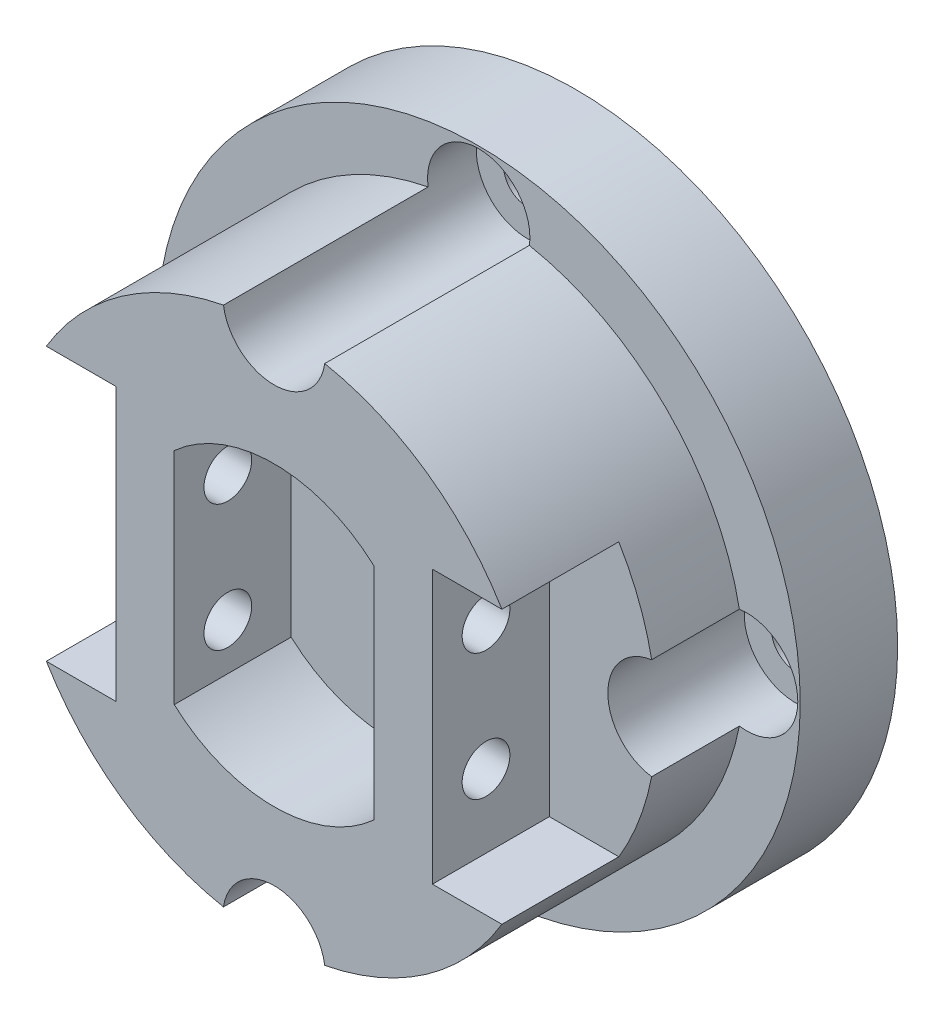
ISO-10303-21;
HEADER;
FILE_DESCRIPTION(('STEP AP214'),'2;1');
FILE_NAME('part.step','',(''),(''),'','','');
FILE_SCHEMA(('AUTOMOTIVE_DESIGN { 1 0 10303 214 1 1 1 1 }'));
ENDSEC;
DATA;
#1=APPLICATION_CONTEXT('core data for automotive mechanical design processes');
#2=APPLICATION_PROTOCOL_DEFINITION('international standard','automotive_design',2000,#1);
#3=PRODUCT_CONTEXT('',#1,'mechanical');
#4=PRODUCT('Part','Part','',(#3));
#5=PRODUCT_RELATED_PRODUCT_CATEGORY('part','',(#4));
#6=PRODUCT_DEFINITION_FORMATION('','',#4);
#7=PRODUCT_DEFINITION_CONTEXT('part definition',#1,'design');
#8=PRODUCT_DEFINITION('design','',#6,#7);
#9=PRODUCT_DEFINITION_SHAPE('','',#8);
#10=(LENGTH_UNIT() NAMED_UNIT(*) SI_UNIT(.MILLI.,.METRE.));
#11=(NAMED_UNIT(*) PLANE_ANGLE_UNIT() SI_UNIT($,.RADIAN.));
#12=(NAMED_UNIT(*) SI_UNIT($,.STERADIAN.) SOLID_ANGLE_UNIT());
#13=UNCERTAINTY_MEASURE_WITH_UNIT(LENGTH_MEASURE(1.E-05),#10,'distance_accuracy_value','');
#14=(GEOMETRIC_REPRESENTATION_CONTEXT(3) GLOBAL_UNCERTAINTY_ASSIGNED_CONTEXT((#13)) GLOBAL_UNIT_ASSIGNED_CONTEXT((#10,
#11,#12)) REPRESENTATION_CONTEXT('',''));
#15=CARTESIAN_POINT('',(0.,0.,0.));
#16=DIRECTION('',(0.,0.,1.));
#17=DIRECTION('',(1.,0.,0.));
#18=AXIS2_PLACEMENT_3D('',#15,#16,#17);
#19=CARTESIAN_POINT('',(0.,-27.5,36.));
#20=DIRECTION('',(0.,0.,-1.));
#21=DIRECTION('',(-1.,0.,0.));
#22=AXIS2_PLACEMENT_3D('',#19,#20,#21);
#23=CYLINDRICAL_SURFACE('',#22,2.45);
#24=CARTESIAN_POINT('',(0.,-27.5,0.));
#25=DIRECTION('',(0.,0.,-1.));
#26=DIRECTION('',(-1.,0.,0.));
#27=AXIS2_PLACEMENT_3D('',#24,#25,#26);
#28=CIRCLE('',#27,2.45);
#29=CARTESIAN_POINT('',(-2.45000000000001,-27.5,0.));
#30=VERTEX_POINT('',#29);
#31=EDGE_CURVE('E353',#30,#30,#28,.T.);
#32=ORIENTED_EDGE('',*,*,#31,.T.);
#33=EDGE_LOOP('',(#32));
#34=FACE_BOUND('',#33,.T.);
#35=CARTESIAN_POINT('',(0.,-27.5,5.));
#36=DIRECTION('',(0.,0.,1.));
#37=DIRECTION('',(1.,0.,0.));
#38=AXIS2_PLACEMENT_3D('',#35,#36,#37);
#39=CIRCLE('',#38,2.45);
#40=CARTESIAN_POINT('',(2.45,-27.5,5.));
#41=VERTEX_POINT('',#40);
#42=EDGE_CURVE('E247',#41,#41,#39,.F.);
#43=ORIENTED_EDGE('',*,*,#42,.F.);
#44=EDGE_LOOP('',(#43));
#45=FACE_BOUND('',#44,.T.);
#46=ADVANCED_FACE('F33',(#34,#45),#23,.F.);
#47=CARTESIAN_POINT('',(-27.5,0.,36.));
#48=DIRECTION('',(0.,0.,-1.));
#49=DIRECTION('',(-1.,0.,0.));
#50=AXIS2_PLACEMENT_3D('',#47,#48,#49);
#51=CYLINDRICAL_SURFACE('',#50,2.45);
#52=CARTESIAN_POINT('',(-27.5,0.,0.));
#53=DIRECTION('',(0.,0.,-1.));
#54=DIRECTION('',(-1.,0.,0.));
#55=AXIS2_PLACEMENT_3D('',#52,#53,#54);
#56=CIRCLE('',#55,2.45);
#57=CARTESIAN_POINT('',(-29.95,0.,0.));
#58=VERTEX_POINT('',#57);
#59=EDGE_CURVE('E350',#58,#58,#56,.T.);
#60=ORIENTED_EDGE('',*,*,#59,.T.);
#61=EDGE_LOOP('',(#60));
#62=FACE_BOUND('',#61,.T.);
#63=CARTESIAN_POINT('',(-27.5,0.,5.));
#64=DIRECTION('',(0.,0.,1.));
#65=DIRECTION('',(1.,0.,0.));
#66=AXIS2_PLACEMENT_3D('',#63,#64,#65);
#67=CIRCLE('',#66,2.45);
#68=CARTESIAN_POINT('',(-25.05,0.,5.));
#69=VERTEX_POINT('',#68);
#70=EDGE_CURVE('E243',#69,#69,#67,.F.);
#71=ORIENTED_EDGE('',*,*,#70,.F.);
#72=EDGE_LOOP('',(#71));
#73=FACE_BOUND('',#72,.T.);
#74=ADVANCED_FACE('F483',(#62,#73),#51,.F.);
#75=CARTESIAN_POINT('',(27.5,0.,36.));
#76=DIRECTION('',(0.,0.,-1.));
#77=DIRECTION('',(-1.,0.,0.));
#78=AXIS2_PLACEMENT_3D('',#75,#76,#77);
#79=CYLINDRICAL_SURFACE('',#78,2.45);
#80=CARTESIAN_POINT('',(27.5,0.,0.));
#81=DIRECTION('',(0.,0.,-1.));
#82=DIRECTION('',(-1.,0.,0.));
#83=AXIS2_PLACEMENT_3D('',#80,#81,#82);
#84=CIRCLE('',#83,2.45);
#85=CARTESIAN_POINT('',(25.05,0.,0.));
#86=VERTEX_POINT('',#85);
#87=EDGE_CURVE('E356',#86,#86,#84,.T.);
#88=ORIENTED_EDGE('',*,*,#87,.T.);
#89=EDGE_LOOP('',(#88));
#90=FACE_BOUND('',#89,.T.);
#91=CARTESIAN_POINT('',(27.5,0.,5.));
#92=DIRECTION('',(0.,0.,1.));
#93=DIRECTION('',(1.,0.,0.));
#94=AXIS2_PLACEMENT_3D('',#91,#92,#93);
#95=CIRCLE('',#94,2.45);
#96=CARTESIAN_POINT('',(29.95,0.,5.));
#97=VERTEX_POINT('',#96);
#98=EDGE_CURVE('E237',#97,#97,#95,.F.);
#99=ORIENTED_EDGE('',*,*,#98,.F.);
#100=EDGE_LOOP('',(#99));
#101=FACE_BOUND('',#100,.T.);
#102=ADVANCED_FACE('F480',(#90,#101),#79,.F.);
#103=CARTESIAN_POINT('',(0.,27.5,36.));
#104=DIRECTION('',(0.,0.,-1.));
#105=DIRECTION('',(-1.,0.,0.));
#106=AXIS2_PLACEMENT_3D('',#103,#104,#105);
#107=CYLINDRICAL_SURFACE('',#106,2.45);
#108=CARTESIAN_POINT('',(0.,27.5,0.));
#109=DIRECTION('',(0.,0.,-1.));
#110=DIRECTION('',(-1.,0.,0.));
#111=AXIS2_PLACEMENT_3D('',#108,#109,#110);
#112=CIRCLE('',#111,2.45);
#113=CARTESIAN_POINT('',(-2.44999999999999,27.5,0.));
#114=VERTEX_POINT('',#113);
#115=EDGE_CURVE('E359',#114,#114,#112,.T.);
#116=ORIENTED_EDGE('',*,*,#115,.T.);
#117=EDGE_LOOP('',(#116));
#118=FACE_BOUND('',#117,.T.);
#119=CARTESIAN_POINT('',(0.,27.5,5.));
#120=DIRECTION('',(0.,0.,1.));
#121=DIRECTION('',(1.,0.,0.));
#122=AXIS2_PLACEMENT_3D('',#119,#120,#121);
#123=CIRCLE('',#122,2.45);
#124=CARTESIAN_POINT('',(2.45000000000001,27.5,5.));
#125=VERTEX_POINT('',#124);
#126=EDGE_CURVE('E228',#125,#125,#123,.F.);
#127=ORIENTED_EDGE('',*,*,#126,.F.);
#128=EDGE_LOOP('',(#127));
#129=FACE_BOUND('',#128,.T.);
#130=ADVANCED_FACE('F482',(#118,#129),#107,.F.);
#131=CARTESIAN_POINT('',(0.,0.,31.));
#132=DIRECTION('',(0.,0.,-1.));
#133=DIRECTION('',(-1.,0.,0.));
#134=AXIS2_PLACEMENT_3D('',#131,#132,#133);
#135=CYLINDRICAL_SURFACE('',#134,27.25);
#136=CARTESIAN_POINT('',(0.,0.,31.));
#137=DIRECTION('',(0.,0.,1.));
#138=DIRECTION('',(1.,0.,0.));
#139=AXIS2_PLACEMENT_3D('',#136,#137,#138);
#140=CIRCLE('',#139,27.25);
#141=CARTESIAN_POINT('',(5.19615242270663,-26.75,31.));
#142=VERTEX_POINT('',#141);
#143=CARTESIAN_POINT('',(23.3786761815121,-14.,31.));
#144=VERTEX_POINT('',#143);
#145=EDGE_CURVE('E181',#142,#144,#140,.T.);
#146=ORIENTED_EDGE('',*,*,#145,.F.);
#147=DIRECTION('',(0.,0.,1.));
#148=VECTOR('',#147,1.);
#149=CARTESIAN_POINT('',(5.19615242270663,-26.75,18.));
#150=LINE('',#149,#148);
#151=CARTESIAN_POINT('',(5.19615242270661,-26.75,10.));
#152=VERTEX_POINT('',#151);
#153=EDGE_CURVE('E167',#142,#152,#150,.F.);
#154=ORIENTED_EDGE('',*,*,#153,.T.);
#155=CARTESIAN_POINT('',(0.,0.,10.));
#156=DIRECTION('',(0.,0.,1.));
#157=DIRECTION('',(1.,0.,0.));
#158=AXIS2_PLACEMENT_3D('',#155,#156,#157);
#159=CIRCLE('',#158,27.25);
#160=CARTESIAN_POINT('',(26.75,-5.19615242270663,10.));
#161=VERTEX_POINT('',#160);
#162=EDGE_CURVE('E462',#152,#161,#159,.T.);
#163=ORIENTED_EDGE('',*,*,#162,.T.);
#164=DIRECTION('',(0.,0.,1.));
#165=VECTOR('',#164,1.);
#166=CARTESIAN_POINT('',(26.75,-5.19615242270664,18.));
#167=LINE('',#166,#165);
#168=CARTESIAN_POINT('',(26.75,-5.19615242270662,19.));
#169=VERTEX_POINT('',#168);
#170=EDGE_CURVE('E269',#161,#169,#167,.T.);
#171=ORIENTED_EDGE('',*,*,#170,.T.);
#172=CARTESIAN_POINT('',(0.,0.,19.));
#173=DIRECTION('',(0.,0.,-1.));
#174=DIRECTION('',(-1.,0.,0.));
#175=AXIS2_PLACEMENT_3D('',#172,#173,#174);
#176=CIRCLE('',#175,27.25);
#177=CARTESIAN_POINT('',(23.3786761815121,-14.,19.));
#178=VERTEX_POINT('',#177);
#179=EDGE_CURVE('E306',#169,#178,#176,.T.);
#180=ORIENTED_EDGE('',*,*,#179,.T.);
#181=DIRECTION('',(0.,0.,-1.));
#182=VECTOR('',#181,1.);
#183=CARTESIAN_POINT('',(23.3786761815121,-14.,31.));
#184=LINE('',#183,#182);
#185=EDGE_CURVE('E191',#144,#178,#184,.T.);
#186=ORIENTED_EDGE('',*,*,#185,.F.);
#187=EDGE_LOOP('',(#146,#154,#163,#171,#180,#186));
#188=FACE_BOUND('',#187,.T.);
#189=ADVANCED_FACE('F189',(#188),#135,.T.);
#190=CARTESIAN_POINT('',(0.,0.,19.));
#191=DIRECTION('',(0.,0.,-1.));
#192=DIRECTION('',(-1.,0.,0.));
#193=AXIS2_PLACEMENT_3D('',#190,#191,#192);
#194=CIRCLE('',#193,27.25);
#195=CARTESIAN_POINT('',(23.3786761815121,14.,19.));
#196=VERTEX_POINT('',#195);
#197=CARTESIAN_POINT('',(26.75,5.19615242270661,19.));
#198=VERTEX_POINT('',#197);
#199=EDGE_CURVE('E303',#196,#198,#194,.T.);
#200=ORIENTED_EDGE('',*,*,#199,.T.);
#201=DIRECTION('',(0.,0.,1.));
#202=VECTOR('',#201,1.);
#203=CARTESIAN_POINT('',(26.75,5.19615242270663,18.));
#204=LINE('',#203,#202);
#205=CARTESIAN_POINT('',(26.75,5.19615242270662,10.));
#206=VERTEX_POINT('',#205);
#207=EDGE_CURVE('E266',#198,#206,#204,.F.);
#208=ORIENTED_EDGE('',*,*,#207,.T.);
#209=CARTESIAN_POINT('',(5.19615242270662,26.75,10.));
#210=VERTEX_POINT('',#209);
#211=EDGE_CURVE('E388',#206,#210,#159,.T.);
#212=ORIENTED_EDGE('',*,*,#211,.T.);
#213=DIRECTION('',(0.,0.,1.));
#214=VECTOR('',#213,1.);
#215=CARTESIAN_POINT('',(5.19615242270664,26.75,18.));
#216=LINE('',#215,#214);
#217=CARTESIAN_POINT('',(5.19615242270664,26.75,31.));
#218=VERTEX_POINT('',#217);
#219=EDGE_CURVE('E278',#210,#218,#216,.T.);
#220=ORIENTED_EDGE('',*,*,#219,.T.);
#221=CARTESIAN_POINT('',(23.3786761815121,14.,31.));
#222=VERTEX_POINT('',#221);
#223=EDGE_CURVE('E192',#222,#218,#140,.T.);
#224=ORIENTED_EDGE('',*,*,#223,.F.);
#225=DIRECTION('',(0.,0.,-1.));
#226=VECTOR('',#225,1.);
#227=CARTESIAN_POINT('',(23.3786761815121,14.,31.));
#228=LINE('',#227,#226);
#229=EDGE_CURVE('E309',#196,#222,#228,.F.);
#230=ORIENTED_EDGE('',*,*,#229,.F.);
#231=EDGE_LOOP('',(#200,#208,#212,#220,#224,#230));
#232=FACE_BOUND('',#231,.T.);
#233=ADVANCED_FACE('F447',(#232),#135,.T.);
#234=CARTESIAN_POINT('',(0.,0.,31.));
#235=DIRECTION('',(0.,0.,1.));
#236=DIRECTION('',(1.,0.,0.));
#237=AXIS2_PLACEMENT_3D('',#234,#235,#236);
#238=PLANE('',#237);
#239=CARTESIAN_POINT('',(0.,-27.5,31.));
#240=DIRECTION('',(0.,0.,1.));
#241=DIRECTION('',(1.,0.,0.));
#242=AXIS2_PLACEMENT_3D('',#239,#240,#241);
#243=CIRCLE('',#242,5.25);
#244=CARTESIAN_POINT('',(-5.19615242270664,-26.75,31.));
#245=VERTEX_POINT('',#244);
#246=EDGE_CURVE('E170',#142,#245,#243,.T.);
#247=ORIENTED_EDGE('',*,*,#246,.F.);
#248=ORIENTED_EDGE('',*,*,#145,.T.);
#249=DIRECTION('',(-1.,0.,0.));
#250=VECTOR('',#249,1.);
#251=CARTESIAN_POINT('',(16.25,-14.,31.));
#252=LINE('',#251,#250);
#253=CARTESIAN_POINT('',(16.25,-14.,31.));
#254=VERTEX_POINT('',#253);
#255=EDGE_CURVE('E294',#144,#254,#252,.T.);
#256=ORIENTED_EDGE('',*,*,#255,.T.);
#257=DIRECTION('',(0.,1.,0.));
#258=VECTOR('',#257,1.);
#259=CARTESIAN_POINT('',(16.25,14.,31.));
#260=LINE('',#259,#258);
#261=CARTESIAN_POINT('',(16.25,14.,31.));
#262=VERTEX_POINT('',#261);
#263=EDGE_CURVE('E281',#254,#262,#260,.T.);
#264=ORIENTED_EDGE('',*,*,#263,.T.);
#265=DIRECTION('',(1.,0.,0.));
#266=VECTOR('',#265,1.);
#267=CARTESIAN_POINT('',(16.25,14.,31.));
#268=LINE('',#267,#266);
#269=EDGE_CURVE('E286',#262,#222,#268,.T.);
#270=ORIENTED_EDGE('',*,*,#269,.T.);
#271=ORIENTED_EDGE('',*,*,#223,.T.);
#272=CARTESIAN_POINT('',(0.,27.5,31.));
#273=DIRECTION('',(0.,0.,1.));
#274=DIRECTION('',(1.,0.,0.));
#275=AXIS2_PLACEMENT_3D('',#272,#273,#274);
#276=CIRCLE('',#275,5.25);
#277=CARTESIAN_POINT('',(-5.19615242270662,26.75,31.));
#278=VERTEX_POINT('',#277);
#279=EDGE_CURVE('E240',#278,#218,#276,.T.);
#280=ORIENTED_EDGE('',*,*,#279,.F.);
#281=CARTESIAN_POINT('',(-23.3786761815121,14.,31.));
#282=VERTEX_POINT('',#281);
#283=EDGE_CURVE('E194',#278,#282,#140,.T.);
#284=ORIENTED_EDGE('',*,*,#283,.T.);
#285=DIRECTION('',(-1.,0.,0.));
#286=VECTOR('',#285,1.);
#287=CARTESIAN_POINT('',(-16.25,14.,31.));
#288=LINE('',#287,#286);
#289=CARTESIAN_POINT('',(-16.25,14.,31.));
#290=VERTEX_POINT('',#289);
#291=EDGE_CURVE('E324',#290,#282,#288,.T.);
#292=ORIENTED_EDGE('',*,*,#291,.F.);
#293=DIRECTION('',(0.,1.,0.));
#294=VECTOR('',#293,1.);
#295=CARTESIAN_POINT('',(-16.25,14.,31.));
#296=LINE('',#295,#294);
#297=CARTESIAN_POINT('',(-16.25,-14.,31.));
#298=VERTEX_POINT('',#297);
#299=EDGE_CURVE('E311',#298,#290,#296,.T.);
#300=ORIENTED_EDGE('',*,*,#299,.F.);
#301=DIRECTION('',(1.,0.,0.));
#302=VECTOR('',#301,1.);
#303=CARTESIAN_POINT('',(-16.25,-14.,31.));
#304=LINE('',#303,#302);
#305=CARTESIAN_POINT('',(-23.3786761815121,-14.,31.));
#306=VERTEX_POINT('',#305);
#307=EDGE_CURVE('E316',#306,#298,#304,.T.);
#308=ORIENTED_EDGE('',*,*,#307,.F.);
#309=EDGE_CURVE('E185',#306,#245,#140,.T.);
#310=ORIENTED_EDGE('',*,*,#309,.T.);
#311=EDGE_LOOP('',(#247,#248,#256,#264,#270,#271,#280,#284,#292,#300,#308,#310));
#312=FACE_BOUND('',#311,.T.);
#313=CARTESIAN_POINT('',(0.,0.,31.));
#314=DIRECTION('',(0.,0.,1.));
#315=DIRECTION('',(1.,0.,0.));
#316=AXIS2_PLACEMENT_3D('',#313,#314,#315);
#317=CIRCLE('',#316,15.25);
#318=CARTESIAN_POINT('',(10.25,11.2915897906362,31.));
#319=VERTEX_POINT('',#318);
#320=CARTESIAN_POINT('',(-10.25,11.2915897906362,31.));
#321=VERTEX_POINT('',#320);
#322=EDGE_CURVE('E362',#319,#321,#317,.T.);
#323=ORIENTED_EDGE('',*,*,#322,.F.);
#324=DIRECTION('',(0.,1.,0.));
#325=VECTOR('',#324,1.);
#326=CARTESIAN_POINT('',(10.25,11.2915897906362,31.));
#327=LINE('',#326,#325);
#328=CARTESIAN_POINT('',(10.25,-11.2915897906362,31.));
#329=VERTEX_POINT('',#328);
#330=EDGE_CURVE('E367',#329,#319,#327,.T.);
#331=ORIENTED_EDGE('',*,*,#330,.F.);
#332=CARTESIAN_POINT('',(0.,0.,31.));
#333=DIRECTION('',(0.,0.,1.));
#334=DIRECTION('',(1.,0.,0.));
#335=AXIS2_PLACEMENT_3D('',#332,#333,#334);
#336=CIRCLE('',#335,15.25);
#337=CARTESIAN_POINT('',(-10.25,-11.2915897906362,31.));
#338=VERTEX_POINT('',#337);
#339=EDGE_CURVE('E381',#338,#329,#336,.T.);
#340=ORIENTED_EDGE('',*,*,#339,.F.);
#341=DIRECTION('',(0.,-1.,0.));
#342=VECTOR('',#341,1.);
#343=CARTESIAN_POINT('',(-10.25,11.2915897906362,31.));
#344=LINE('',#343,#342);
#345=EDGE_CURVE('E378',#321,#338,#344,.T.);
#346=ORIENTED_EDGE('',*,*,#345,.F.);
#347=EDGE_LOOP('',(#323,#331,#340,#346));
#348=FACE_BOUND('',#347,.T.);
#349=ADVANCED_FACE('F178',(#312,#348),#238,.T.);
#350=CARTESIAN_POINT('',(-27.75,6.49999999999999,25.5));
#351=DIRECTION('',(1.,0.,0.));
#352=DIRECTION('',(0.,1.,0.));
#353=AXIS2_PLACEMENT_3D('',#350,#351,#352);
#354=CYLINDRICAL_SURFACE('',#353,2.45);
#355=CARTESIAN_POINT('',(10.25,6.5,25.5));
#356=DIRECTION('',(1.,0.,0.));
#357=DIRECTION('',(0.,1.,0.));
#358=AXIS2_PLACEMENT_3D('',#355,#356,#357);
#359=CIRCLE('',#358,2.45);
#360=CARTESIAN_POINT('',(10.25,8.95,25.5));
#361=VERTEX_POINT('',#360);
#362=EDGE_CURVE('E216',#361,#361,#359,.F.);
#363=ORIENTED_EDGE('',*,*,#362,.T.);
#364=EDGE_LOOP('',(#363));
#365=FACE_BOUND('',#364,.T.);
#366=CARTESIAN_POINT('',(16.25,6.50000000000001,25.5));
#367=DIRECTION('',(1.,0.,0.));
#368=DIRECTION('',(0.,1.,0.));
#369=AXIS2_PLACEMENT_3D('',#366,#367,#368);
#370=CIRCLE('',#369,2.45);
#371=CARTESIAN_POINT('',(16.25,8.95000000000001,25.5));
#372=VERTEX_POINT('',#371);
#373=EDGE_CURVE('E226',#372,#372,#370,.T.);
#374=ORIENTED_EDGE('',*,*,#373,.T.);
#375=EDGE_LOOP('',(#374));
#376=FACE_BOUND('',#375,.T.);
#377=ADVANCED_FACE('F421',(#365,#376),#354,.F.);
#378=CARTESIAN_POINT('',(-27.75,-6.50000000000001,25.5));
#379=DIRECTION('',(1.,0.,0.));
#380=DIRECTION('',(0.,1.,0.));
#381=AXIS2_PLACEMENT_3D('',#378,#379,#380);
#382=CYLINDRICAL_SURFACE('',#381,2.45);
#383=CARTESIAN_POINT('',(10.25,-6.5,25.5));
#384=DIRECTION('',(1.,0.,0.));
#385=DIRECTION('',(0.,1.,0.));
#386=AXIS2_PLACEMENT_3D('',#383,#384,#385);
#387=CIRCLE('',#386,2.45);
#388=CARTESIAN_POINT('',(10.25,-4.05,25.5));
#389=VERTEX_POINT('',#388);
#390=EDGE_CURVE('E217',#389,#389,#387,.F.);
#391=ORIENTED_EDGE('',*,*,#390,.T.);
#392=EDGE_LOOP('',(#391));
#393=FACE_BOUND('',#392,.T.);
#394=CARTESIAN_POINT('',(16.25,-6.49999999999999,25.5));
#395=DIRECTION('',(1.,0.,0.));
#396=DIRECTION('',(0.,1.,0.));
#397=AXIS2_PLACEMENT_3D('',#394,#395,#396);
#398=CIRCLE('',#397,2.45);
#399=CARTESIAN_POINT('',(16.25,-4.04999999999999,25.5));
#400=VERTEX_POINT('',#399);
#401=EDGE_CURVE('E223',#400,#400,#398,.T.);
#402=ORIENTED_EDGE('',*,*,#401,.T.);
#403=EDGE_LOOP('',(#402));
#404=FACE_BOUND('',#403,.T.);
#405=ADVANCED_FACE('F414',(#393,#404),#382,.F.);
#406=CARTESIAN_POINT('',(10.25,11.2915897906362,19.));
#407=DIRECTION('',(1.,0.,0.));
#408=DIRECTION('',(0.,1.,0.));
#409=AXIS2_PLACEMENT_3D('',#406,#407,#408);
#410=PLANE('',#409);
#411=ORIENTED_EDGE('',*,*,#362,.F.);
#412=EDGE_LOOP('',(#411));
#413=FACE_BOUND('',#412,.T.);
#414=ORIENTED_EDGE('',*,*,#330,.T.);
#415=DIRECTION('',(0.,0.,1.));
#416=VECTOR('',#415,1.);
#417=CARTESIAN_POINT('',(10.25,11.2915897906362,19.));
#418=LINE('',#417,#416);
#419=CARTESIAN_POINT('',(10.25,11.2915897906362,19.));
#420=VERTEX_POINT('',#419);
#421=EDGE_CURVE('E386',#420,#319,#418,.T.);
#422=ORIENTED_EDGE('',*,*,#421,.F.);
#423=DIRECTION('',(0.,1.,0.));
#424=VECTOR('',#423,1.);
#425=CARTESIAN_POINT('',(10.25,11.2915897906362,19.));
#426=LINE('',#425,#424);
#427=CARTESIAN_POINT('',(10.25,-11.2915897906362,19.));
#428=VERTEX_POINT('',#427);
#429=EDGE_CURVE('E373',#428,#420,#426,.T.);
#430=ORIENTED_EDGE('',*,*,#429,.F.);
#431=DIRECTION('',(0.,0.,1.));
#432=VECTOR('',#431,1.);
#433=CARTESIAN_POINT('',(10.25,-11.2915897906362,19.));
#434=LINE('',#433,#432);
#435=EDGE_CURVE('E389',#428,#329,#434,.T.);
#436=ORIENTED_EDGE('',*,*,#435,.T.);
#437=EDGE_LOOP('',(#414,#422,#430,#436));
#438=FACE_BOUND('',#437,.T.);
#439=ORIENTED_EDGE('',*,*,#390,.F.);
#440=EDGE_LOOP('',(#439));
#441=FACE_BOUND('',#440,.T.);
#442=ADVANCED_FACE('F411',(#413,#438,#441),#410,.F.);
#443=CARTESIAN_POINT('',(-10.25,11.2915897906362,19.));
#444=DIRECTION('',(-1.,0.,0.));
#445=DIRECTION('',(0.,0.,1.));
#446=AXIS2_PLACEMENT_3D('',#443,#444,#445);
#447=PLANE('',#446);
#448=CARTESIAN_POINT('',(-10.25,6.5,25.5));
#449=DIRECTION('',(-1.,0.,0.));
#450=DIRECTION('',(0.,0.,1.));
#451=AXIS2_PLACEMENT_3D('',#448,#449,#450);
#452=CIRCLE('',#451,2.45);
#453=CARTESIAN_POINT('',(-10.25,6.5,27.95));
#454=VERTEX_POINT('',#453);
#455=EDGE_CURVE('E213',#454,#454,#452,.F.);
#456=ORIENTED_EDGE('',*,*,#455,.F.);
#457=EDGE_LOOP('',(#456));
#458=FACE_BOUND('',#457,.T.);
#459=ORIENTED_EDGE('',*,*,#345,.T.);
#460=DIRECTION('',(0.,0.,1.));
#461=VECTOR('',#460,1.);
#462=CARTESIAN_POINT('',(-10.25,-11.2915897906362,19.));
#463=LINE('',#462,#461);
#464=CARTESIAN_POINT('',(-10.25,-11.2915897906362,19.));
#465=VERTEX_POINT('',#464);
#466=EDGE_CURVE('E391',#465,#338,#463,.T.);
#467=ORIENTED_EDGE('',*,*,#466,.F.);
#468=DIRECTION('',(0.,-1.,0.));
#469=VECTOR('',#468,1.);
#470=CARTESIAN_POINT('',(-10.25,11.2915897906362,19.));
#471=LINE('',#470,#469);
#472=CARTESIAN_POINT('',(-10.25,11.2915897906362,19.));
#473=VERTEX_POINT('',#472);
#474=EDGE_CURVE('E366',#473,#465,#471,.T.);
#475=ORIENTED_EDGE('',*,*,#474,.F.);
#476=DIRECTION('',(0.,0.,1.));
#477=VECTOR('',#476,1.);
#478=CARTESIAN_POINT('',(-10.25,11.2915897906362,19.));
#479=LINE('',#478,#477);
#480=EDGE_CURVE('E376',#473,#321,#479,.T.);
#481=ORIENTED_EDGE('',*,*,#480,.T.);
#482=EDGE_LOOP('',(#459,#467,#475,#481));
#483=FACE_BOUND('',#482,.T.);
#484=CARTESIAN_POINT('',(-10.25,-6.5,25.5));
#485=DIRECTION('',(-1.,0.,0.));
#486=DIRECTION('',(0.,0.,1.));
#487=AXIS2_PLACEMENT_3D('',#484,#485,#486);
#488=CIRCLE('',#487,2.45);
#489=CARTESIAN_POINT('',(-10.25,-6.5,27.95));
#490=VERTEX_POINT('',#489);
#491=EDGE_CURVE('E343',#490,#490,#488,.F.);
#492=ORIENTED_EDGE('',*,*,#491,.F.);
#493=EDGE_LOOP('',(#492));
#494=FACE_BOUND('',#493,.T.);
#495=ADVANCED_FACE('F396',(#458,#483,#494),#447,.F.);
#496=CARTESIAN_POINT('',(-26.75,-5.19615242270665,10.));
#497=VERTEX_POINT('',#496);
#498=CARTESIAN_POINT('',(-5.19615242270662,-26.75,10.));
#499=VERTEX_POINT('',#498);
#500=EDGE_CURVE('E461',#497,#499,#159,.T.);
#501=ORIENTED_EDGE('',*,*,#500,.T.);
#502=DIRECTION('',(0.,0.,1.));
#503=VECTOR('',#502,1.);
#504=CARTESIAN_POINT('',(-5.19615242270664,-26.75,18.));
#505=LINE('',#504,#503);
#506=EDGE_CURVE('E47',#499,#245,#505,.T.);
#507=ORIENTED_EDGE('',*,*,#506,.T.);
#508=ORIENTED_EDGE('',*,*,#309,.F.);
#509=DIRECTION('',(0.,0.,-1.));
#510=VECTOR('',#509,1.);
#511=CARTESIAN_POINT('',(-23.3786761815121,-14.,31.));
#512=LINE('',#511,#510);
#513=CARTESIAN_POINT('',(-23.3786761815121,-14.,19.));
#514=VERTEX_POINT('',#513);
#515=EDGE_CURVE('E340',#306,#514,#512,.T.);
#516=ORIENTED_EDGE('',*,*,#515,.T.);
#517=CARTESIAN_POINT('',(0.,0.,19.));
#518=DIRECTION('',(0.,0.,-1.));
#519=DIRECTION('',(-1.,0.,0.));
#520=AXIS2_PLACEMENT_3D('',#517,#518,#519);
#521=CIRCLE('',#520,27.25);
#522=CARTESIAN_POINT('',(-26.75,-5.19615242270662,19.));
#523=VERTEX_POINT('',#522);
#524=EDGE_CURVE('E334',#514,#523,#521,.T.);
#525=ORIENTED_EDGE('',*,*,#524,.T.);
#526=DIRECTION('',(0.,0.,1.));
#527=VECTOR('',#526,1.);
#528=CARTESIAN_POINT('',(-26.75,-5.19615242270664,18.));
#529=LINE('',#528,#527);
#530=EDGE_CURVE('E55',#523,#497,#529,.F.);
#531=ORIENTED_EDGE('',*,*,#530,.T.);
#532=EDGE_LOOP('',(#501,#507,#508,#516,#525,#531));
#533=FACE_BOUND('',#532,.T.);
#534=ADVANCED_FACE('F664',(#533),#135,.T.);
#535=CARTESIAN_POINT('',(-5.1961524227066,26.75,10.));
#536=VERTEX_POINT('',#535);
#537=CARTESIAN_POINT('',(-26.75,5.19615242270663,10.));
#538=VERTEX_POINT('',#537);
#539=EDGE_CURVE('E196',#536,#538,#159,.T.);
#540=ORIENTED_EDGE('',*,*,#539,.T.);
#541=DIRECTION('',(0.,0.,1.));
#542=VECTOR('',#541,1.);
#543=CARTESIAN_POINT('',(-26.75,5.19615242270663,18.));
#544=LINE('',#543,#542);
#545=CARTESIAN_POINT('',(-26.75,5.19615242270661,19.));
#546=VERTEX_POINT('',#545);
#547=EDGE_CURVE('E259',#538,#546,#544,.T.);
#548=ORIENTED_EDGE('',*,*,#547,.T.);
#549=CARTESIAN_POINT('',(0.,0.,19.));
#550=DIRECTION('',(0.,0.,-1.));
#551=DIRECTION('',(-1.,0.,0.));
#552=AXIS2_PLACEMENT_3D('',#549,#550,#551);
#553=CIRCLE('',#552,27.25);
#554=CARTESIAN_POINT('',(-23.3786761815121,14.,19.));
#555=VERTEX_POINT('',#554);
#556=EDGE_CURVE('E332',#546,#555,#553,.T.);
#557=ORIENTED_EDGE('',*,*,#556,.T.);
#558=DIRECTION('',(0.,0.,-1.));
#559=VECTOR('',#558,1.);
#560=CARTESIAN_POINT('',(-23.3786761815121,14.,31.));
#561=LINE('',#560,#559);
#562=EDGE_CURVE('E337',#555,#282,#561,.F.);
#563=ORIENTED_EDGE('',*,*,#562,.T.);
#564=ORIENTED_EDGE('',*,*,#283,.F.);
#565=DIRECTION('',(0.,0.,1.));
#566=VECTOR('',#565,1.);
#567=CARTESIAN_POINT('',(-5.19615242270662,26.75,18.));
#568=LINE('',#567,#566);
#569=EDGE_CURVE('E231',#278,#536,#568,.F.);
#570=ORIENTED_EDGE('',*,*,#569,.T.);
#571=EDGE_LOOP('',(#540,#548,#557,#563,#564,#570));
#572=FACE_BOUND('',#571,.T.);
#573=ADVANCED_FACE('F657',(#572),#135,.T.);
#574=CARTESIAN_POINT('',(0.,0.,10.));
#575=DIRECTION('',(0.,0.,1.));
#576=DIRECTION('',(1.,0.,0.));
#577=AXIS2_PLACEMENT_3D('',#574,#575,#576);
#578=PLANE('',#577);
#579=CARTESIAN_POINT('',(0.,-27.5,10.));
#580=DIRECTION('',(0.,0.,1.));
#581=DIRECTION('',(1.,0.,0.));
#582=AXIS2_PLACEMENT_3D('',#579,#580,#581);
#583=CIRCLE('',#582,5.25);
#584=EDGE_CURVE('E13',#499,#152,#583,.T.);
#585=ORIENTED_EDGE('',*,*,#584,.F.);
#586=ORIENTED_EDGE('',*,*,#500,.F.);
#587=CARTESIAN_POINT('',(-27.5,0.,10.));
#588=DIRECTION('',(0.,0.,1.));
#589=DIRECTION('',(1.,0.,0.));
#590=AXIS2_PLACEMENT_3D('',#587,#588,#589);
#591=CIRCLE('',#590,5.25);
#592=EDGE_CURVE('E246',#538,#497,#591,.T.);
#593=ORIENTED_EDGE('',*,*,#592,.F.);
#594=ORIENTED_EDGE('',*,*,#539,.F.);
#595=CARTESIAN_POINT('',(0.,27.5,10.));
#596=DIRECTION('',(0.,0.,1.));
#597=DIRECTION('',(1.,0.,0.));
#598=AXIS2_PLACEMENT_3D('',#595,#596,#597);
#599=CIRCLE('',#598,5.25);
#600=EDGE_CURVE('E210',#210,#536,#599,.T.);
#601=ORIENTED_EDGE('',*,*,#600,.F.);
#602=ORIENTED_EDGE('',*,*,#211,.F.);
#603=CARTESIAN_POINT('',(27.5,0.,10.));
#604=DIRECTION('',(0.,0.,1.));
#605=DIRECTION('',(1.,0.,0.));
#606=AXIS2_PLACEMENT_3D('',#603,#604,#605);
#607=CIRCLE('',#606,5.25);
#608=EDGE_CURVE('E241',#161,#206,#607,.T.);
#609=ORIENTED_EDGE('',*,*,#608,.F.);
#610=ORIENTED_EDGE('',*,*,#162,.F.);
#611=EDGE_LOOP('',(#585,#586,#593,#594,#601,#602,#609,#610));
#612=FACE_BOUND('',#611,.T.);
#613=CARTESIAN_POINT('',(0.,0.,10.));
#614=DIRECTION('',(0.,0.,1.));
#615=DIRECTION('',(1.,0.,0.));
#616=AXIS2_PLACEMENT_3D('',#613,#614,#615);
#617=CIRCLE('',#616,33.);
#618=CARTESIAN_POINT('',(33.,0.,10.));
#619=VERTEX_POINT('',#618);
#620=EDGE_CURVE('E205',#619,#619,#617,.T.);
#621=ORIENTED_EDGE('',*,*,#620,.T.);
#622=EDGE_LOOP('',(#621));
#623=FACE_BOUND('',#622,.T.);
#624=ADVANCED_FACE('F454',(#612,#623),#578,.T.);
#625=CARTESIAN_POINT('',(0.,0.,10.));
#626=DIRECTION('',(0.,0.,-1.));
#627=DIRECTION('',(-1.,0.,0.));
#628=AXIS2_PLACEMENT_3D('',#625,#626,#627);
#629=CYLINDRICAL_SURFACE('',#628,33.);
#630=ORIENTED_EDGE('',*,*,#620,.F.);
#631=EDGE_LOOP('',(#630));
#632=FACE_BOUND('',#631,.T.);
#633=CARTESIAN_POINT('',(0.,0.,0.));
#634=DIRECTION('',(0.,0.,1.));
#635=DIRECTION('',(1.,0.,0.));
#636=AXIS2_PLACEMENT_3D('',#633,#634,#635);
#637=CIRCLE('',#636,33.);
#638=CARTESIAN_POINT('',(33.,0.,0.));
#639=VERTEX_POINT('',#638);
#640=EDGE_CURVE('E199',#639,#639,#637,.T.);
#641=ORIENTED_EDGE('',*,*,#640,.T.);
#642=EDGE_LOOP('',(#641));
#643=FACE_BOUND('',#642,.T.);
#644=ADVANCED_FACE('F35',(#632,#643),#629,.T.);
#645=CARTESIAN_POINT('',(0.,0.,0.));
#646=DIRECTION('',(0.,0.,1.));
#647=DIRECTION('',(1.,0.,0.));
#648=AXIS2_PLACEMENT_3D('',#645,#646,#647);
#649=PLANE('',#648);
#650=ORIENTED_EDGE('',*,*,#59,.F.);
#651=EDGE_LOOP('',(#650));
#652=FACE_BOUND('',#651,.T.);
#653=ORIENTED_EDGE('',*,*,#31,.F.);
#654=EDGE_LOOP('',(#653));
#655=FACE_BOUND('',#654,.T.);
#656=ORIENTED_EDGE('',*,*,#87,.F.);
#657=EDGE_LOOP('',(#656));
#658=FACE_BOUND('',#657,.T.);
#659=ORIENTED_EDGE('',*,*,#115,.F.);
#660=EDGE_LOOP('',(#659));
#661=FACE_BOUND('',#660,.T.);
#662=ORIENTED_EDGE('',*,*,#640,.F.);
#663=EDGE_LOOP('',(#662));
#664=FACE_BOUND('',#663,.T.);
#665=ADVANCED_FACE('F639',(#652,#655,#658,#661,#664),#649,.F.);
#666=CARTESIAN_POINT('',(0.,0.,19.));
#667=DIRECTION('',(0.,0.,1.));
#668=DIRECTION('',(1.,0.,0.));
#669=AXIS2_PLACEMENT_3D('',#666,#667,#668);
#670=CYLINDRICAL_SURFACE('',#669,15.25);
#671=ORIENTED_EDGE('',*,*,#322,.T.);
#672=ORIENTED_EDGE('',*,*,#480,.F.);
#673=CARTESIAN_POINT('',(0.,0.,19.));
#674=DIRECTION('',(0.,0.,1.));
#675=DIRECTION('',(1.,0.,0.));
#676=AXIS2_PLACEMENT_3D('',#673,#674,#675);
#677=CIRCLE('',#676,15.25);
#678=EDGE_CURVE('E363',#420,#473,#677,.T.);
#679=ORIENTED_EDGE('',*,*,#678,.F.);
#680=ORIENTED_EDGE('',*,*,#421,.T.);
#681=EDGE_LOOP('',(#671,#672,#679,#680));
#682=FACE_BOUND('',#681,.T.);
#683=ADVANCED_FACE('F409',(#682),#670,.F.);
#684=CARTESIAN_POINT('',(0.,0.,19.));
#685=DIRECTION('',(0.,0.,1.));
#686=DIRECTION('',(1.,0.,0.));
#687=AXIS2_PLACEMENT_3D('',#684,#685,#686);
#688=CYLINDRICAL_SURFACE('',#687,15.25);
#689=ORIENTED_EDGE('',*,*,#339,.T.);
#690=ORIENTED_EDGE('',*,*,#435,.F.);
#691=CARTESIAN_POINT('',(0.,0.,19.));
#692=DIRECTION('',(0.,0.,1.));
#693=DIRECTION('',(1.,0.,0.));
#694=AXIS2_PLACEMENT_3D('',#691,#692,#693);
#695=CIRCLE('',#694,15.25);
#696=EDGE_CURVE('E370',#465,#428,#695,.T.);
#697=ORIENTED_EDGE('',*,*,#696,.F.);
#698=ORIENTED_EDGE('',*,*,#466,.T.);
#699=EDGE_LOOP('',(#689,#690,#697,#698));
#700=FACE_BOUND('',#699,.T.);
#701=ADVANCED_FACE('F404',(#700),#688,.F.);
#702=CARTESIAN_POINT('',(0.,0.,19.));
#703=DIRECTION('',(0.,0.,1.));
#704=DIRECTION('',(1.,0.,0.));
#705=AXIS2_PLACEMENT_3D('',#702,#703,#704);
#706=PLANE('',#705);
#707=ORIENTED_EDGE('',*,*,#678,.T.);
#708=ORIENTED_EDGE('',*,*,#474,.T.);
#709=ORIENTED_EDGE('',*,*,#696,.T.);
#710=ORIENTED_EDGE('',*,*,#429,.T.);
#711=EDGE_LOOP('',(#707,#708,#709,#710));
#712=FACE_BOUND('',#711,.T.);
#713=ADVANCED_FACE('F408',(#712),#706,.T.);
#714=CARTESIAN_POINT('',(-16.25,6.49999999999999,25.5));
#715=DIRECTION('',(1.,0.,0.));
#716=DIRECTION('',(0.,1.,0.));
#717=AXIS2_PLACEMENT_3D('',#714,#715,#716);
#718=CIRCLE('',#717,2.45);
#719=CARTESIAN_POINT('',(-16.25,8.95,25.5));
#720=VERTEX_POINT('',#719);
#721=EDGE_CURVE('E221',#720,#720,#718,.T.);
#722=ORIENTED_EDGE('',*,*,#721,.F.);
#723=EDGE_LOOP('',(#722));
#724=FACE_BOUND('',#723,.T.);
#725=ORIENTED_EDGE('',*,*,#455,.T.);
#726=EDGE_LOOP('',(#725));
#727=FACE_BOUND('',#726,.T.);
#728=ADVANCED_FACE('F501',(#724,#727),#354,.F.);
#729=CARTESIAN_POINT('',(-16.25,-6.50000000000001,25.5));
#730=DIRECTION('',(1.,0.,0.));
#731=DIRECTION('',(0.,1.,0.));
#732=AXIS2_PLACEMENT_3D('',#729,#730,#731);
#733=CIRCLE('',#732,2.45);
#734=CARTESIAN_POINT('',(-16.25,-4.05,25.5));
#735=VERTEX_POINT('',#734);
#736=EDGE_CURVE('E218',#735,#735,#733,.T.);
#737=ORIENTED_EDGE('',*,*,#736,.F.);
#738=EDGE_LOOP('',(#737));
#739=FACE_BOUND('',#738,.T.);
#740=ORIENTED_EDGE('',*,*,#491,.T.);
#741=EDGE_LOOP('',(#740));
#742=FACE_BOUND('',#741,.T.);
#743=ADVANCED_FACE('F423',(#739,#742),#382,.F.);
#744=CARTESIAN_POINT('',(-16.25,-14.,19.));
#745=DIRECTION('',(0.,-1.,0.));
#746=DIRECTION('',(1.,0.,0.));
#747=AXIS2_PLACEMENT_3D('',#744,#745,#746);
#748=PLANE('',#747);
#749=ORIENTED_EDGE('',*,*,#307,.T.);
#750=DIRECTION('',(0.,0.,1.));
#751=VECTOR('',#750,1.);
#752=CARTESIAN_POINT('',(-16.25,-14.,19.));
#753=LINE('',#752,#751);
#754=CARTESIAN_POINT('',(-16.25,-14.,19.));
#755=VERTEX_POINT('',#754);
#756=EDGE_CURVE('E222',#755,#298,#753,.T.);
#757=ORIENTED_EDGE('',*,*,#756,.F.);
#758=DIRECTION('',(1.,0.,0.));
#759=VECTOR('',#758,1.);
#760=CARTESIAN_POINT('',(-16.25,-14.,19.));
#761=LINE('',#760,#759);
#762=EDGE_CURVE('E319',#514,#755,#761,.T.);
#763=ORIENTED_EDGE('',*,*,#762,.F.);
#764=ORIENTED_EDGE('',*,*,#515,.F.);
#765=EDGE_LOOP('',(#749,#757,#763,#764));
#766=FACE_BOUND('',#765,.T.);
#767=ADVANCED_FACE('F513',(#766),#748,.F.);
#768=CARTESIAN_POINT('',(-16.25,14.,19.));
#769=DIRECTION('',(0.,1.,0.));
#770=DIRECTION('',(-1.,0.,0.));
#771=AXIS2_PLACEMENT_3D('',#768,#769,#770);
#772=PLANE('',#771);
#773=DIRECTION('',(-1.,0.,0.));
#774=VECTOR('',#773,1.);
#775=CARTESIAN_POINT('',(-16.25,14.,19.));
#776=LINE('',#775,#774);
#777=CARTESIAN_POINT('',(-16.25,14.,19.));
#778=VERTEX_POINT('',#777);
#779=EDGE_CURVE('E315',#778,#555,#776,.T.);
#780=ORIENTED_EDGE('',*,*,#779,.F.);
#781=DIRECTION('',(0.,0.,1.));
#782=VECTOR('',#781,1.);
#783=CARTESIAN_POINT('',(-16.25,14.,19.));
#784=LINE('',#783,#782);
#785=EDGE_CURVE('E321',#778,#290,#784,.T.);
#786=ORIENTED_EDGE('',*,*,#785,.T.);
#787=ORIENTED_EDGE('',*,*,#291,.T.);
#788=ORIENTED_EDGE('',*,*,#562,.F.);
#789=EDGE_LOOP('',(#780,#786,#787,#788));
#790=FACE_BOUND('',#789,.T.);
#791=ADVANCED_FACE('F510',(#790),#772,.F.);
#792=CARTESIAN_POINT('',(-16.25,-14.,19.));
#793=DIRECTION('',(0.,0.,-1.));
#794=DIRECTION('',(-1.,0.,0.));
#795=AXIS2_PLACEMENT_3D('',#792,#793,#794);
#796=PLANE('',#795);
#797=ORIENTED_EDGE('',*,*,#556,.F.);
#798=CARTESIAN_POINT('',(-27.5,0.,19.));
#799=DIRECTION('',(0.,0.,-1.));
#800=DIRECTION('',(-1.,0.,0.));
#801=AXIS2_PLACEMENT_3D('',#798,#799,#800);
#802=CIRCLE('',#801,5.25);
#803=EDGE_CURVE('E41',#546,#523,#802,.T.);
#804=ORIENTED_EDGE('',*,*,#803,.T.);
#805=ORIENTED_EDGE('',*,*,#524,.F.);
#806=ORIENTED_EDGE('',*,*,#762,.T.);
#807=DIRECTION('',(0.,1.,0.));
#808=VECTOR('',#807,1.);
#809=CARTESIAN_POINT('',(-16.25,14.,19.));
#810=LINE('',#809,#808);
#811=EDGE_CURVE('E312',#755,#778,#810,.T.);
#812=ORIENTED_EDGE('',*,*,#811,.T.);
#813=ORIENTED_EDGE('',*,*,#779,.T.);
#814=EDGE_LOOP('',(#797,#804,#805,#806,#812,#813));
#815=FACE_BOUND('',#814,.T.);
#816=ADVANCED_FACE('F508',(#815),#796,.F.);
#817=CARTESIAN_POINT('',(-16.25,14.,19.));
#818=DIRECTION('',(1.,0.,0.));
#819=DIRECTION('',(0.,1.,0.));
#820=AXIS2_PLACEMENT_3D('',#817,#818,#819);
#821=PLANE('',#820);
#822=ORIENTED_EDGE('',*,*,#721,.T.);
#823=EDGE_LOOP('',(#822));
#824=FACE_BOUND('',#823,.T.);
#825=ORIENTED_EDGE('',*,*,#736,.T.);
#826=EDGE_LOOP('',(#825));
#827=FACE_BOUND('',#826,.T.);
#828=ORIENTED_EDGE('',*,*,#299,.T.);
#829=ORIENTED_EDGE('',*,*,#785,.F.);
#830=ORIENTED_EDGE('',*,*,#811,.F.);
#831=ORIENTED_EDGE('',*,*,#756,.T.);
#832=EDGE_LOOP('',(#828,#829,#830,#831));
#833=FACE_BOUND('',#832,.T.);
#834=ADVANCED_FACE('F505',(#824,#827,#833),#821,.F.);
#835=CARTESIAN_POINT('',(16.25,14.,19.));
#836=DIRECTION('',(0.,-1.,0.));
#837=DIRECTION('',(1.,0.,0.));
#838=AXIS2_PLACEMENT_3D('',#835,#836,#837);
#839=PLANE('',#838);
#840=ORIENTED_EDGE('',*,*,#229,.T.);
#841=ORIENTED_EDGE('',*,*,#269,.F.);
#842=DIRECTION('',(0.,0.,1.));
#843=VECTOR('',#842,1.);
#844=CARTESIAN_POINT('',(16.25,14.,19.));
#845=LINE('',#844,#843);
#846=CARTESIAN_POINT('',(16.25,14.,19.));
#847=VERTEX_POINT('',#846);
#848=EDGE_CURVE('E227',#847,#262,#845,.T.);
#849=ORIENTED_EDGE('',*,*,#848,.F.);
#850=DIRECTION('',(1.,0.,0.));
#851=VECTOR('',#850,1.);
#852=CARTESIAN_POINT('',(16.25,14.,19.));
#853=LINE('',#852,#851);
#854=EDGE_CURVE('E288',#847,#196,#853,.T.);
#855=ORIENTED_EDGE('',*,*,#854,.T.);
#856=EDGE_LOOP('',(#840,#841,#849,#855));
#857=FACE_BOUND('',#856,.T.);
#858=ADVANCED_FACE('F443',(#857),#839,.T.);
#859=CARTESIAN_POINT('',(16.25,-14.,19.));
#860=DIRECTION('',(0.,1.,0.));
#861=DIRECTION('',(-1.,0.,0.));
#862=AXIS2_PLACEMENT_3D('',#859,#860,#861);
#863=PLANE('',#862);
#864=ORIENTED_EDGE('',*,*,#185,.T.);
#865=DIRECTION('',(-1.,0.,0.));
#866=VECTOR('',#865,1.);
#867=CARTESIAN_POINT('',(16.25,-14.,19.));
#868=LINE('',#867,#866);
#869=CARTESIAN_POINT('',(16.25,-14.,19.));
#870=VERTEX_POINT('',#869);
#871=EDGE_CURVE('E285',#178,#870,#868,.T.);
#872=ORIENTED_EDGE('',*,*,#871,.T.);
#873=DIRECTION('',(0.,0.,1.));
#874=VECTOR('',#873,1.);
#875=CARTESIAN_POINT('',(16.25,-14.,19.));
#876=LINE('',#875,#874);
#877=EDGE_CURVE('E291',#870,#254,#876,.T.);
#878=ORIENTED_EDGE('',*,*,#877,.T.);
#879=ORIENTED_EDGE('',*,*,#255,.F.);
#880=EDGE_LOOP('',(#864,#872,#878,#879));
#881=FACE_BOUND('',#880,.T.);
#882=ADVANCED_FACE('F438',(#881),#863,.T.);
#883=CARTESIAN_POINT('',(16.25,-14.,19.));
#884=DIRECTION('',(0.,0.,-1.));
#885=DIRECTION('',(1.,0.,0.));
#886=AXIS2_PLACEMENT_3D('',#883,#884,#885);
#887=PLANE('',#886);
#888=ORIENTED_EDGE('',*,*,#179,.F.);
#889=CARTESIAN_POINT('',(27.5,0.,19.));
#890=DIRECTION('',(0.,0.,-1.));
#891=DIRECTION('',(-1.,0.,0.));
#892=AXIS2_PLACEMENT_3D('',#889,#890,#891);
#893=CIRCLE('',#892,5.25);
#894=EDGE_CURVE('E234',#169,#198,#893,.T.);
#895=ORIENTED_EDGE('',*,*,#894,.T.);
#896=ORIENTED_EDGE('',*,*,#199,.F.);
#897=ORIENTED_EDGE('',*,*,#854,.F.);
#898=DIRECTION('',(0.,1.,0.));
#899=VECTOR('',#898,1.);
#900=CARTESIAN_POINT('',(16.25,14.,19.));
#901=LINE('',#900,#899);
#902=EDGE_CURVE('E282',#870,#847,#901,.T.);
#903=ORIENTED_EDGE('',*,*,#902,.F.);
#904=ORIENTED_EDGE('',*,*,#871,.F.);
#905=EDGE_LOOP('',(#888,#895,#896,#897,#903,#904));
#906=FACE_BOUND('',#905,.T.);
#907=ADVANCED_FACE('F430',(#906),#887,.F.);
#908=CARTESIAN_POINT('',(16.25,14.,19.));
#909=DIRECTION('',(1.,0.,0.));
#910=DIRECTION('',(0.,1.,0.));
#911=AXIS2_PLACEMENT_3D('',#908,#909,#910);
#912=PLANE('',#911);
#913=ORIENTED_EDGE('',*,*,#373,.F.);
#914=EDGE_LOOP('',(#913));
#915=FACE_BOUND('',#914,.T.);
#916=ORIENTED_EDGE('',*,*,#401,.F.);
#917=EDGE_LOOP('',(#916));
#918=FACE_BOUND('',#917,.T.);
#919=ORIENTED_EDGE('',*,*,#263,.F.);
#920=ORIENTED_EDGE('',*,*,#877,.F.);
#921=ORIENTED_EDGE('',*,*,#902,.T.);
#922=ORIENTED_EDGE('',*,*,#848,.T.);
#923=EDGE_LOOP('',(#919,#920,#921,#922));
#924=FACE_BOUND('',#923,.T.);
#925=ADVANCED_FACE('F426',(#915,#918,#924),#912,.T.);
#926=CARTESIAN_POINT('',(0.,27.5,-14.8492424049175));
#927=DIRECTION('',(0.,0.,1.));
#928=DIRECTION('',(1.,0.,0.));
#929=AXIS2_PLACEMENT_3D('',#926,#927,#928);
#930=CYLINDRICAL_SURFACE('',#929,5.25);
#931=CARTESIAN_POINT('',(0.,27.5,5.));
#932=DIRECTION('',(0.,0.,1.));
#933=DIRECTION('',(1.,0.,0.));
#934=AXIS2_PLACEMENT_3D('',#931,#932,#933);
#935=CIRCLE('',#934,5.25);
#936=CARTESIAN_POINT('',(5.25000000000001,27.5,5.));
#937=VERTEX_POINT('',#936);
#938=EDGE_CURVE('E232',#937,#937,#935,.F.);
#939=ORIENTED_EDGE('',*,*,#938,.T.);
#940=EDGE_LOOP('',(#939));
#941=FACE_BOUND('',#940,.T.);
#942=ORIENTED_EDGE('',*,*,#600,.T.);
#943=ORIENTED_EDGE('',*,*,#569,.F.);
#944=ORIENTED_EDGE('',*,*,#279,.T.);
#945=ORIENTED_EDGE('',*,*,#219,.F.);
#946=EDGE_LOOP('',(#942,#943,#944,#945));
#947=FACE_BOUND('',#946,.T.);
#948=ADVANCED_FACE('F429',(#941,#947),#930,.F.);
#949=CARTESIAN_POINT('',(0.,0.,5.));
#950=DIRECTION('',(0.,0.,1.));
#951=DIRECTION('',(1.,0.,0.));
#952=AXIS2_PLACEMENT_3D('',#949,#950,#951);
#953=PLANE('',#952);
#954=ORIENTED_EDGE('',*,*,#938,.F.);
#955=EDGE_LOOP('',(#954));
#956=FACE_BOUND('',#955,.T.);
#957=ORIENTED_EDGE('',*,*,#126,.T.);
#958=EDGE_LOOP('',(#957));
#959=FACE_BOUND('',#958,.T.);
#960=ADVANCED_FACE('F476',(#956,#959),#953,.T.);
#961=CARTESIAN_POINT('',(0.,0.,5.));
#962=DIRECTION('',(0.,0.,1.));
#963=DIRECTION('',(1.,0.,0.));
#964=AXIS2_PLACEMENT_3D('',#961,#962,#963);
#965=PLANE('',#964);
#966=CARTESIAN_POINT('',(27.5,0.,5.));
#967=DIRECTION('',(0.,0.,1.));
#968=DIRECTION('',(1.,0.,0.));
#969=AXIS2_PLACEMENT_3D('',#966,#967,#968);
#970=CIRCLE('',#969,5.25);
#971=CARTESIAN_POINT('',(32.75,0.,5.));
#972=VERTEX_POINT('',#971);
#973=EDGE_CURVE('E245',#972,#972,#970,.F.);
#974=ORIENTED_EDGE('',*,*,#973,.F.);
#975=EDGE_LOOP('',(#974));
#976=FACE_BOUND('',#975,.T.);
#977=ORIENTED_EDGE('',*,*,#98,.T.);
#978=EDGE_LOOP('',(#977));
#979=FACE_BOUND('',#978,.T.);
#980=ADVANCED_FACE('F470',(#976,#979),#965,.T.);
#981=CARTESIAN_POINT('',(27.5,0.,-14.8492424049175));
#982=DIRECTION('',(0.,0.,1.));
#983=DIRECTION('',(1.,0.,0.));
#984=AXIS2_PLACEMENT_3D('',#981,#982,#983);
#985=CYLINDRICAL_SURFACE('',#984,5.25);
#986=ORIENTED_EDGE('',*,*,#608,.T.);
#987=ORIENTED_EDGE('',*,*,#207,.F.);
#988=ORIENTED_EDGE('',*,*,#894,.F.);
#989=ORIENTED_EDGE('',*,*,#170,.F.);
#990=EDGE_LOOP('',(#986,#987,#988,#989));
#991=FACE_BOUND('',#990,.T.);
#992=ORIENTED_EDGE('',*,*,#973,.T.);
#993=EDGE_LOOP('',(#992));
#994=FACE_BOUND('',#993,.T.);
#995=ADVANCED_FACE('F466',(#991,#994),#985,.F.);
#996=CARTESIAN_POINT('',(0.,0.,5.));
#997=DIRECTION('',(0.,0.,1.));
#998=DIRECTION('',(1.,0.,0.));
#999=AXIS2_PLACEMENT_3D('',#996,#997,#998);
#1000=PLANE('',#999);
#1001=CARTESIAN_POINT('',(-27.5,0.,5.));
#1002=DIRECTION('',(0.,0.,1.));
#1003=DIRECTION('',(1.,0.,0.));
#1004=AXIS2_PLACEMENT_3D('',#1001,#1002,#1003);
#1005=CIRCLE('',#1004,5.25);
#1006=CARTESIAN_POINT('',(-22.25,0.,5.));
#1007=VERTEX_POINT('',#1006);
#1008=EDGE_CURVE('E174',#1007,#1007,#1005,.F.);
#1009=ORIENTED_EDGE('',*,*,#1008,.F.);
#1010=EDGE_LOOP('',(#1009));
#1011=FACE_BOUND('',#1010,.T.);
#1012=ORIENTED_EDGE('',*,*,#70,.T.);
#1013=EDGE_LOOP('',(#1012));
#1014=FACE_BOUND('',#1013,.T.);
#1015=ADVANCED_FACE('F469',(#1011,#1014),#1000,.T.);
#1016=CARTESIAN_POINT('',(-27.5,0.,-14.8492424049175));
#1017=DIRECTION('',(0.,0.,1.));
#1018=DIRECTION('',(1.,0.,0.));
#1019=AXIS2_PLACEMENT_3D('',#1016,#1017,#1018);
#1020=CYLINDRICAL_SURFACE('',#1019,5.25);
#1021=ORIENTED_EDGE('',*,*,#592,.T.);
#1022=ORIENTED_EDGE('',*,*,#530,.F.);
#1023=ORIENTED_EDGE('',*,*,#803,.F.);
#1024=ORIENTED_EDGE('',*,*,#547,.F.);
#1025=EDGE_LOOP('',(#1021,#1022,#1023,#1024));
#1026=FACE_BOUND('',#1025,.T.);
#1027=ORIENTED_EDGE('',*,*,#1008,.T.);
#1028=EDGE_LOOP('',(#1027));
#1029=FACE_BOUND('',#1028,.T.);
#1030=ADVANCED_FACE('F533',(#1026,#1029),#1020,.F.);
#1031=CARTESIAN_POINT('',(0.,-27.5,-14.8492424049175));
#1032=DIRECTION('',(0.,0.,1.));
#1033=DIRECTION('',(1.,0.,0.));
#1034=AXIS2_PLACEMENT_3D('',#1031,#1032,#1033);
#1035=CYLINDRICAL_SURFACE('',#1034,5.25);
#1036=CARTESIAN_POINT('',(0.,-27.5,5.));
#1037=DIRECTION('',(0.,0.,1.));
#1038=DIRECTION('',(1.,0.,0.));
#1039=AXIS2_PLACEMENT_3D('',#1036,#1037,#1038);
#1040=CIRCLE('',#1039,5.25);
#1041=CARTESIAN_POINT('',(5.24999999999999,-27.5,5.));
#1042=VERTEX_POINT('',#1041);
#1043=EDGE_CURVE('E186',#1042,#1042,#1040,.F.);
#1044=ORIENTED_EDGE('',*,*,#1043,.T.);
#1045=EDGE_LOOP('',(#1044));
#1046=FACE_BOUND('',#1045,.T.);
#1047=ORIENTED_EDGE('',*,*,#246,.T.);
#1048=ORIENTED_EDGE('',*,*,#506,.F.);
#1049=ORIENTED_EDGE('',*,*,#584,.T.);
#1050=ORIENTED_EDGE('',*,*,#153,.F.);
#1051=EDGE_LOOP('',(#1047,#1048,#1049,#1050));
#1052=FACE_BOUND('',#1051,.T.);
#1053=ADVANCED_FACE('F169',(#1046,#1052),#1035,.F.);
#1054=CARTESIAN_POINT('',(0.,0.,5.));
#1055=DIRECTION('',(0.,0.,1.));
#1056=DIRECTION('',(1.,0.,0.));
#1057=AXIS2_PLACEMENT_3D('',#1054,#1055,#1056);
#1058=PLANE('',#1057);
#1059=ORIENTED_EDGE('',*,*,#1043,.F.);
#1060=EDGE_LOOP('',(#1059));
#1061=FACE_BOUND('',#1060,.T.);
#1062=ORIENTED_EDGE('',*,*,#42,.T.);
#1063=EDGE_LOOP('',(#1062));
#1064=FACE_BOUND('',#1063,.T.);
#1065=ADVANCED_FACE('F541',(#1061,#1064),#1058,.T.);
#1066=CLOSED_SHELL('',(#46,#74,#102,#130,#189,#233,#349,#377,#405,#442,#495,#534,#573,#624,#644,
#665,#683,#701,#713,#728,#743,#767,#791,#816,#834,#858,#882,#907,#925,#948,#960,#980,#995,#1015,
#1030,#1053,#1065));
#1067=MANIFOLD_SOLID_BREP('B2',#1066);
#1068=ADVANCED_BREP_SHAPE_REPRESENTATION('',(#18,#1067),#14);
#1069=SHAPE_DEFINITION_REPRESENTATION(#9,#1068);
ENDSEC;
END-ISO-10303-21;
